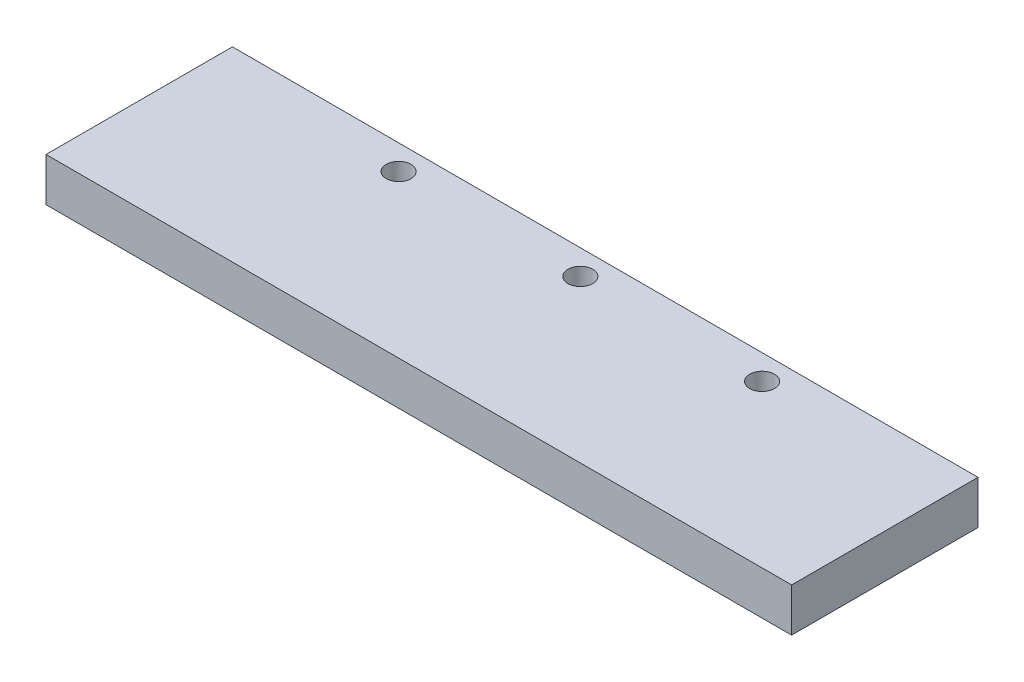
ISO-10303-21;
HEADER;
FILE_DESCRIPTION(('STEP AP214'),'2;1');
FILE_NAME('part.step','',(''),(''),'','','');
FILE_SCHEMA(('AUTOMOTIVE_DESIGN { 1 0 10303 214 1 1 1 1 }'));
ENDSEC;
DATA;
#1=APPLICATION_CONTEXT('core data for automotive mechanical design processes');
#2=APPLICATION_PROTOCOL_DEFINITION('international standard','automotive_design',2000,#1);
#3=PRODUCT_CONTEXT('',#1,'mechanical');
#4=PRODUCT('Part','Part','',(#3));
#5=PRODUCT_RELATED_PRODUCT_CATEGORY('part','',(#4));
#6=PRODUCT_DEFINITION_FORMATION('','',#4);
#7=PRODUCT_DEFINITION_CONTEXT('part definition',#1,'design');
#8=PRODUCT_DEFINITION('design','',#6,#7);
#9=PRODUCT_DEFINITION_SHAPE('','',#8);
#10=(LENGTH_UNIT() NAMED_UNIT(*) SI_UNIT(.MILLI.,.METRE.));
#11=(NAMED_UNIT(*) PLANE_ANGLE_UNIT() SI_UNIT($,.RADIAN.));
#12=(NAMED_UNIT(*) SI_UNIT($,.STERADIAN.) SOLID_ANGLE_UNIT());
#13=UNCERTAINTY_MEASURE_WITH_UNIT(LENGTH_MEASURE(1.E-05),#10,'distance_accuracy_value','');
#14=(GEOMETRIC_REPRESENTATION_CONTEXT(3) GLOBAL_UNCERTAINTY_ASSIGNED_CONTEXT((#13)) GLOBAL_UNIT_ASSIGNED_CONTEXT((#10,
#11,#12)) REPRESENTATION_CONTEXT('',''));
#15=CARTESIAN_POINT('',(0.,0.,0.));
#16=DIRECTION('',(0.,0.,1.));
#17=DIRECTION('',(1.,0.,0.));
#18=AXIS2_PLACEMENT_3D('',#15,#16,#17);
#19=CARTESIAN_POINT('',(-102.510460251046,7.,-65.1673640167364));
#20=DIRECTION('',(0.,0.,-1.));
#21=DIRECTION('',(-1.,0.,0.));
#22=AXIS2_PLACEMENT_3D('',#19,#20,#21);
#23=PLANE('',#22);
#24=DIRECTION('',(1.,0.,0.));
#25=VECTOR('',#24,1.);
#26=CARTESIAN_POINT('',(-102.510460251046,0.,-65.1673640167364));
#27=LINE('',#26,#25);
#28=CARTESIAN_POINT('',(-102.510460251046,0.,-65.1673640167364));
#29=VERTEX_POINT('',#28);
#30=CARTESIAN_POINT('',(17.4895397489539,0.,-65.1673640167364));
#31=VERTEX_POINT('',#30);
#32=EDGE_CURVE('E101',#29,#31,#27,.T.);
#33=ORIENTED_EDGE('',*,*,#32,.F.);
#34=DIRECTION('',(0.,-1.,0.));
#35=VECTOR('',#34,1.);
#36=CARTESIAN_POINT('',(-102.510460251046,7.,-65.1673640167364));
#37=LINE('',#36,#35);
#38=CARTESIAN_POINT('',(-102.510460251046,7.,-65.1673640167364));
#39=VERTEX_POINT('',#38);
#40=EDGE_CURVE('E11',#39,#29,#37,.T.);
#41=ORIENTED_EDGE('',*,*,#40,.F.);
#42=DIRECTION('',(1.,0.,0.));
#43=VECTOR('',#42,1.);
#44=CARTESIAN_POINT('',(-102.510460251046,7.,-65.1673640167364));
#45=LINE('',#44,#43);
#46=CARTESIAN_POINT('',(17.4895397489539,7.,-65.1673640167364));
#47=VERTEX_POINT('',#46);
#48=EDGE_CURVE('E95',#39,#47,#45,.T.);
#49=ORIENTED_EDGE('',*,*,#48,.T.);
#50=DIRECTION('',(0.,-1.,0.));
#51=VECTOR('',#50,1.);
#52=CARTESIAN_POINT('',(17.4895397489539,7.,-65.1673640167364));
#53=LINE('',#52,#51);
#54=EDGE_CURVE('E38',#47,#31,#53,.T.);
#55=ORIENTED_EDGE('',*,*,#54,.T.);
#56=EDGE_LOOP('',(#33,#41,#49,#55));
#57=FACE_BOUND('',#56,.T.);
#58=ADVANCED_FACE('F35',(#57),#23,.T.);
#59=CARTESIAN_POINT('',(-102.510460251046,7.,-65.1673640167364));
#60=DIRECTION('',(1.,0.,0.));
#61=DIRECTION('',(0.,0.,-1.));
#62=AXIS2_PLACEMENT_3D('',#59,#60,#61);
#63=PLANE('',#62);
#64=DIRECTION('',(0.,0.,1.));
#65=VECTOR('',#64,1.);
#66=CARTESIAN_POINT('',(-102.510460251046,0.,-65.1673640167364));
#67=LINE('',#66,#65);
#68=CARTESIAN_POINT('',(-102.510460251046,0.,-35.1673640167364));
#69=VERTEX_POINT('',#68);
#70=EDGE_CURVE('E68',#29,#69,#67,.T.);
#71=ORIENTED_EDGE('',*,*,#70,.T.);
#72=DIRECTION('',(0.,-1.,0.));
#73=VECTOR('',#72,1.);
#74=CARTESIAN_POINT('',(-102.510460251046,7.,-35.1673640167364));
#75=LINE('',#74,#73);
#76=CARTESIAN_POINT('',(-102.510460251046,7.,-35.1673640167364));
#77=VERTEX_POINT('',#76);
#78=EDGE_CURVE('E44',#77,#69,#75,.T.);
#79=ORIENTED_EDGE('',*,*,#78,.F.);
#80=DIRECTION('',(0.,0.,1.));
#81=VECTOR('',#80,1.);
#82=CARTESIAN_POINT('',(-102.510460251046,7.,-65.1673640167364));
#83=LINE('',#82,#81);
#84=EDGE_CURVE('E85',#39,#77,#83,.T.);
#85=ORIENTED_EDGE('',*,*,#84,.F.);
#86=ORIENTED_EDGE('',*,*,#40,.T.);
#87=EDGE_LOOP('',(#71,#79,#85,#86));
#88=FACE_BOUND('',#87,.T.);
#89=ADVANCED_FACE('F112',(#88),#63,.F.);
#90=CARTESIAN_POINT('',(-102.510460251046,7.,-35.1673640167364));
#91=DIRECTION('',(0.,0.,-1.));
#92=DIRECTION('',(-1.,0.,0.));
#93=AXIS2_PLACEMENT_3D('',#90,#91,#92);
#94=PLANE('',#93);
#95=DIRECTION('',(1.,0.,0.));
#96=VECTOR('',#95,1.);
#97=CARTESIAN_POINT('',(-102.510460251046,0.,-35.1673640167364));
#98=LINE('',#97,#96);
#99=CARTESIAN_POINT('',(17.4895397489539,0.,-35.1673640167364));
#100=VERTEX_POINT('',#99);
#101=EDGE_CURVE('E92',#69,#100,#98,.T.);
#102=ORIENTED_EDGE('',*,*,#101,.T.);
#103=DIRECTION('',(0.,-1.,0.));
#104=VECTOR('',#103,1.);
#105=CARTESIAN_POINT('',(17.4895397489539,7.,-35.1673640167364));
#106=LINE('',#105,#104);
#107=CARTESIAN_POINT('',(17.4895397489539,7.,-35.1673640167364));
#108=VERTEX_POINT('',#107);
#109=EDGE_CURVE('E89',#108,#100,#106,.T.);
#110=ORIENTED_EDGE('',*,*,#109,.F.);
#111=DIRECTION('',(1.,0.,0.));
#112=VECTOR('',#111,1.);
#113=CARTESIAN_POINT('',(-102.510460251046,7.,-35.1673640167364));
#114=LINE('',#113,#112);
#115=EDGE_CURVE('E80',#77,#108,#114,.T.);
#116=ORIENTED_EDGE('',*,*,#115,.F.);
#117=ORIENTED_EDGE('',*,*,#78,.T.);
#118=EDGE_LOOP('',(#102,#110,#116,#117));
#119=FACE_BOUND('',#118,.T.);
#120=ADVANCED_FACE('F90',(#119),#94,.F.);
#121=CARTESIAN_POINT('',(17.4895397489539,7.,-65.1673640167364));
#122=DIRECTION('',(1.,0.,0.));
#123=DIRECTION('',(0.,0.,-1.));
#124=AXIS2_PLACEMENT_3D('',#121,#122,#123);
#125=PLANE('',#124);
#126=DIRECTION('',(0.,0.,1.));
#127=VECTOR('',#126,1.);
#128=CARTESIAN_POINT('',(17.4895397489539,0.,-65.1673640167364));
#129=LINE('',#128,#127);
#130=EDGE_CURVE('E104',#31,#100,#129,.T.);
#131=ORIENTED_EDGE('',*,*,#130,.F.);
#132=ORIENTED_EDGE('',*,*,#54,.F.);
#133=DIRECTION('',(0.,0.,1.));
#134=VECTOR('',#133,1.);
#135=CARTESIAN_POINT('',(17.4895397489539,7.,-65.1673640167364));
#136=LINE('',#135,#134);
#137=EDGE_CURVE('E84',#47,#108,#136,.T.);
#138=ORIENTED_EDGE('',*,*,#137,.T.);
#139=ORIENTED_EDGE('',*,*,#109,.T.);
#140=EDGE_LOOP('',(#131,#132,#138,#139));
#141=FACE_BOUND('',#140,.T.);
#142=ADVANCED_FACE('F94',(#141),#125,.T.);
#143=CARTESIAN_POINT('',(0.,7.,0.));
#144=DIRECTION('',(0.,-1.,0.));
#145=DIRECTION('',(0.,0.,-1.));
#146=AXIS2_PLACEMENT_3D('',#143,#144,#145);
#147=PLANE('',#146);
#148=CARTESIAN_POINT('',(-71.7604602510461,7.,-61.1673640167364));
#149=DIRECTION('',(0.,-1.,0.));
#150=DIRECTION('',(0.,0.,-1.));
#151=AXIS2_PLACEMENT_3D('',#148,#149,#150);
#152=CIRCLE('',#151,2.);
#153=CARTESIAN_POINT('',(-71.7604602510461,7.,-63.1673640167364));
#154=VERTEX_POINT('',#153);
#155=EDGE_CURVE('E105',#154,#154,#152,.T.);
#156=ORIENTED_EDGE('',*,*,#155,.T.);
#157=EDGE_LOOP('',(#156));
#158=FACE_BOUND('',#157,.T.);
#159=CARTESIAN_POINT('',(-42.5104602510461,7.,-61.1673640167364));
#160=DIRECTION('',(0.,-1.,0.));
#161=DIRECTION('',(0.,0.,-1.));
#162=AXIS2_PLACEMENT_3D('',#159,#160,#161);
#163=CIRCLE('',#162,2.);
#164=CARTESIAN_POINT('',(-42.5104602510461,7.,-63.1673640167364));
#165=VERTEX_POINT('',#164);
#166=EDGE_CURVE('E153',#165,#165,#163,.T.);
#167=ORIENTED_EDGE('',*,*,#166,.T.);
#168=EDGE_LOOP('',(#167));
#169=FACE_BOUND('',#168,.T.);
#170=CARTESIAN_POINT('',(-13.2604602510461,7.,-61.1673640167364));
#171=DIRECTION('',(0.,-1.,0.));
#172=DIRECTION('',(0.,0.,-1.));
#173=AXIS2_PLACEMENT_3D('',#170,#171,#172);
#174=CIRCLE('',#173,2.00000000000001);
#175=CARTESIAN_POINT('',(-13.2604602510461,7.,-63.1673640167364));
#176=VERTEX_POINT('',#175);
#177=EDGE_CURVE('E155',#176,#176,#174,.T.);
#178=ORIENTED_EDGE('',*,*,#177,.T.);
#179=EDGE_LOOP('',(#178));
#180=FACE_BOUND('',#179,.T.);
#181=ORIENTED_EDGE('',*,*,#48,.F.);
#182=ORIENTED_EDGE('',*,*,#84,.T.);
#183=ORIENTED_EDGE('',*,*,#115,.T.);
#184=ORIENTED_EDGE('',*,*,#137,.F.);
#185=EDGE_LOOP('',(#181,#182,#183,#184));
#186=FACE_BOUND('',#185,.T.);
#187=ADVANCED_FACE('F83',(#158,#169,#180,#186),#147,.F.);
#188=CARTESIAN_POINT('',(0.,0.,0.));
#189=DIRECTION('',(0.,-1.,0.));
#190=DIRECTION('',(0.,0.,-1.));
#191=AXIS2_PLACEMENT_3D('',#188,#189,#190);
#192=PLANE('',#191);
#193=CARTESIAN_POINT('',(-71.7604602510461,0.,-61.1673640167364));
#194=DIRECTION('',(0.,-1.,0.));
#195=DIRECTION('',(0.,0.,-1.));
#196=AXIS2_PLACEMENT_3D('',#193,#194,#195);
#197=CIRCLE('',#196,2.);
#198=CARTESIAN_POINT('',(-71.7604602510461,0.,-63.1673640167364));
#199=VERTEX_POINT('',#198);
#200=EDGE_CURVE('E151',#199,#199,#197,.T.);
#201=ORIENTED_EDGE('',*,*,#200,.F.);
#202=EDGE_LOOP('',(#201));
#203=FACE_BOUND('',#202,.T.);
#204=CARTESIAN_POINT('',(-42.5104602510461,0.,-61.1673640167364));
#205=DIRECTION('',(0.,-1.,0.));
#206=DIRECTION('',(0.,0.,-1.));
#207=AXIS2_PLACEMENT_3D('',#204,#205,#206);
#208=CIRCLE('',#207,2.);
#209=CARTESIAN_POINT('',(-42.5104602510461,0.,-63.1673640167364));
#210=VERTEX_POINT('',#209);
#211=EDGE_CURVE('E163',#210,#210,#208,.T.);
#212=ORIENTED_EDGE('',*,*,#211,.F.);
#213=EDGE_LOOP('',(#212));
#214=FACE_BOUND('',#213,.T.);
#215=CARTESIAN_POINT('',(-13.2604602510461,0.,-61.1673640167364));
#216=DIRECTION('',(0.,-1.,0.));
#217=DIRECTION('',(0.,0.,-1.));
#218=AXIS2_PLACEMENT_3D('',#215,#216,#217);
#219=CIRCLE('',#218,2.00000000000001);
#220=CARTESIAN_POINT('',(-13.2604602510461,0.,-63.1673640167364));
#221=VERTEX_POINT('',#220);
#222=EDGE_CURVE('E160',#221,#221,#219,.T.);
#223=ORIENTED_EDGE('',*,*,#222,.F.);
#224=EDGE_LOOP('',(#223));
#225=FACE_BOUND('',#224,.T.);
#226=ORIENTED_EDGE('',*,*,#32,.T.);
#227=ORIENTED_EDGE('',*,*,#130,.T.);
#228=ORIENTED_EDGE('',*,*,#101,.F.);
#229=ORIENTED_EDGE('',*,*,#70,.F.);
#230=EDGE_LOOP('',(#226,#227,#228,#229));
#231=FACE_BOUND('',#230,.T.);
#232=ADVANCED_FACE('F110',(#203,#214,#225,#231),#192,.T.);
#233=CARTESIAN_POINT('',(-13.2604602510461,10.,-61.1673640167364));
#234=DIRECTION('',(0.,-1.,0.));
#235=DIRECTION('',(0.,0.,-1.));
#236=AXIS2_PLACEMENT_3D('',#233,#234,#235);
#237=CYLINDRICAL_SURFACE('',#236,2.00000000000001);
#238=ORIENTED_EDGE('',*,*,#222,.T.);
#239=EDGE_LOOP('',(#238));
#240=FACE_BOUND('',#239,.T.);
#241=ORIENTED_EDGE('',*,*,#177,.F.);
#242=EDGE_LOOP('',(#241));
#243=FACE_BOUND('',#242,.T.);
#244=ADVANCED_FACE('F131',(#240,#243),#237,.F.);
#245=CARTESIAN_POINT('',(-42.5104602510461,10.,-61.1673640167364));
#246=DIRECTION('',(0.,-1.,0.));
#247=DIRECTION('',(0.,0.,-1.));
#248=AXIS2_PLACEMENT_3D('',#245,#246,#247);
#249=CYLINDRICAL_SURFACE('',#248,2.);
#250=ORIENTED_EDGE('',*,*,#211,.T.);
#251=EDGE_LOOP('',(#250));
#252=FACE_BOUND('',#251,.T.);
#253=ORIENTED_EDGE('',*,*,#166,.F.);
#254=EDGE_LOOP('',(#253));
#255=FACE_BOUND('',#254,.T.);
#256=ADVANCED_FACE('F138',(#252,#255),#249,.F.);
#257=CARTESIAN_POINT('',(-71.7604602510461,10.,-61.1673640167364));
#258=DIRECTION('',(0.,-1.,0.));
#259=DIRECTION('',(0.,0.,-1.));
#260=AXIS2_PLACEMENT_3D('',#257,#258,#259);
#261=CYLINDRICAL_SURFACE('',#260,2.);
#262=ORIENTED_EDGE('',*,*,#200,.T.);
#263=EDGE_LOOP('',(#262));
#264=FACE_BOUND('',#263,.T.);
#265=ORIENTED_EDGE('',*,*,#155,.F.);
#266=EDGE_LOOP('',(#265));
#267=FACE_BOUND('',#266,.T.);
#268=ADVANCED_FACE('F142',(#264,#267),#261,.F.);
#269=CLOSED_SHELL('',(#58,#89,#120,#142,#187,#232,#244,#256,#268));
#270=MANIFOLD_SOLID_BREP('B2',#269);
#271=ADVANCED_BREP_SHAPE_REPRESENTATION('',(#18,#270),#14);
#272=SHAPE_DEFINITION_REPRESENTATION(#9,#271);
ENDSEC;
END-ISO-10303-21;
